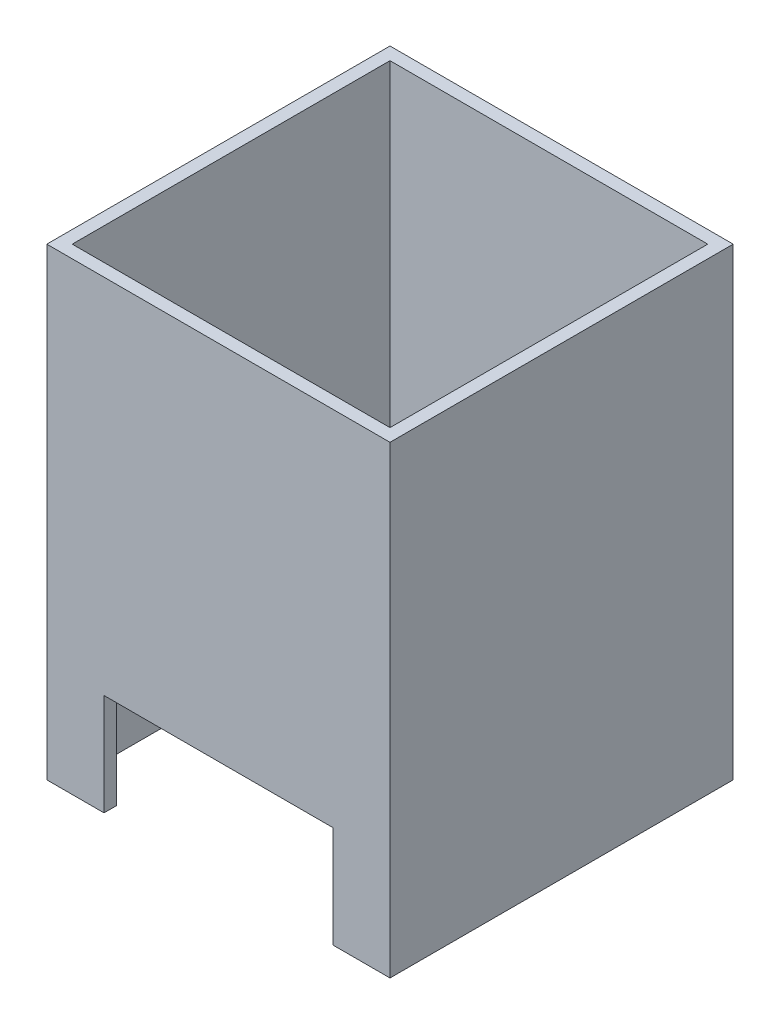
ISO-10303-21;
HEADER;
FILE_DESCRIPTION(('STEP AP214'),'2;1');
FILE_NAME('part.step','',(''),(''),'','','');
FILE_SCHEMA(('AUTOMOTIVE_DESIGN { 1 0 10303 214 1 1 1 1 }'));
ENDSEC;
DATA;
#1=APPLICATION_CONTEXT('core data for automotive mechanical design processes');
#2=APPLICATION_PROTOCOL_DEFINITION('international standard','automotive_design',2000,#1);
#3=PRODUCT_CONTEXT('',#1,'mechanical');
#4=PRODUCT('Part','Part','',(#3));
#5=PRODUCT_RELATED_PRODUCT_CATEGORY('part','',(#4));
#6=PRODUCT_DEFINITION_FORMATION('','',#4);
#7=PRODUCT_DEFINITION_CONTEXT('part definition',#1,'design');
#8=PRODUCT_DEFINITION('design','',#6,#7);
#9=PRODUCT_DEFINITION_SHAPE('','',#8);
#10=(LENGTH_UNIT() NAMED_UNIT(*) SI_UNIT(.MILLI.,.METRE.));
#11=(NAMED_UNIT(*) PLANE_ANGLE_UNIT() SI_UNIT($,.RADIAN.));
#12=(NAMED_UNIT(*) SI_UNIT($,.STERADIAN.) SOLID_ANGLE_UNIT());
#13=UNCERTAINTY_MEASURE_WITH_UNIT(LENGTH_MEASURE(1.E-05),#10,'distance_accuracy_value','');
#14=(GEOMETRIC_REPRESENTATION_CONTEXT(3) GLOBAL_UNCERTAINTY_ASSIGNED_CONTEXT((#13)) GLOBAL_UNIT_ASSIGNED_CONTEXT((#10,
#11,#12)) REPRESENTATION_CONTEXT('',''));
#15=CARTESIAN_POINT('',(0.,0.,0.));
#16=DIRECTION('',(0.,0.,1.));
#17=DIRECTION('',(1.,0.,0.));
#18=AXIS2_PLACEMENT_3D('',#15,#16,#17);
#19=CARTESIAN_POINT('',(0.,0.,0.));
#20=DIRECTION('',(0.,-1.,0.));
#21=DIRECTION('',(0.,0.,-1.));
#22=AXIS2_PLACEMENT_3D('',#19,#20,#21);
#23=PLANE('',#22);
#24=DIRECTION('',(0.,0.,1.));
#25=VECTOR('',#24,1.);
#26=CARTESIAN_POINT('',(18.,0.,-27.001));
#27=LINE('',#26,#25);
#28=CARTESIAN_POINT('',(18.,0.,25.));
#29=VERTEX_POINT('',#28);
#30=CARTESIAN_POINT('',(18.,0.,27.));
#31=VERTEX_POINT('',#30);
#32=EDGE_CURVE('E191',#29,#31,#27,.T.);
#33=ORIENTED_EDGE('',*,*,#32,.F.);
#34=DIRECTION('',(1.,0.,0.));
#35=VECTOR('',#34,1.);
#36=CARTESIAN_POINT('',(-25.,0.,25.));
#37=LINE('',#36,#35);
#38=CARTESIAN_POINT('',(25.,0.,25.));
#39=VERTEX_POINT('',#38);
#40=EDGE_CURVE('E196',#29,#39,#37,.T.);
#41=ORIENTED_EDGE('',*,*,#40,.T.);
#42=DIRECTION('',(0.,0.,-1.));
#43=VECTOR('',#42,1.);
#44=CARTESIAN_POINT('',(25.,0.,25.));
#45=LINE('',#44,#43);
#46=CARTESIAN_POINT('',(25.,0.,-25.));
#47=VERTEX_POINT('',#46);
#48=EDGE_CURVE('E269',#39,#47,#45,.T.);
#49=ORIENTED_EDGE('',*,*,#48,.T.);
#50=DIRECTION('',(-1.,0.,0.));
#51=VECTOR('',#50,1.);
#52=CARTESIAN_POINT('',(-25.,0.,-25.));
#53=LINE('',#52,#51);
#54=CARTESIAN_POINT('',(-25.,0.,-25.));
#55=VERTEX_POINT('',#54);
#56=EDGE_CURVE('E286',#47,#55,#53,.T.);
#57=ORIENTED_EDGE('',*,*,#56,.T.);
#58=DIRECTION('',(0.,0.,1.));
#59=VECTOR('',#58,1.);
#60=CARTESIAN_POINT('',(-25.,0.,25.));
#61=LINE('',#60,#59);
#62=CARTESIAN_POINT('',(-25.,0.,25.));
#63=VERTEX_POINT('',#62);
#64=EDGE_CURVE('E289',#55,#63,#61,.T.);
#65=ORIENTED_EDGE('',*,*,#64,.T.);
#66=CARTESIAN_POINT('',(-18.,0.,25.));
#67=VERTEX_POINT('',#66);
#68=EDGE_CURVE('E274',#63,#67,#37,.T.);
#69=ORIENTED_EDGE('',*,*,#68,.T.);
#70=DIRECTION('',(0.,0.,1.));
#71=VECTOR('',#70,1.);
#72=CARTESIAN_POINT('',(-18.,0.,-27.001));
#73=LINE('',#72,#71);
#74=CARTESIAN_POINT('',(-18.,0.,27.));
#75=VERTEX_POINT('',#74);
#76=EDGE_CURVE('E50',#67,#75,#73,.T.);
#77=ORIENTED_EDGE('',*,*,#76,.T.);
#78=DIRECTION('',(1.,0.,0.));
#79=VECTOR('',#78,1.);
#80=CARTESIAN_POINT('',(-27.,0.,27.));
#81=LINE('',#80,#79);
#82=CARTESIAN_POINT('',(-27.,0.,27.));
#83=VERTEX_POINT('',#82);
#84=EDGE_CURVE('E310',#83,#75,#81,.T.);
#85=ORIENTED_EDGE('',*,*,#84,.F.);
#86=DIRECTION('',(0.,0.,1.));
#87=VECTOR('',#86,1.);
#88=CARTESIAN_POINT('',(-27.,0.,27.));
#89=LINE('',#88,#87);
#90=CARTESIAN_POINT('',(-27.,0.,-27.));
#91=VERTEX_POINT('',#90);
#92=EDGE_CURVE('E307',#91,#83,#89,.T.);
#93=ORIENTED_EDGE('',*,*,#92,.F.);
#94=DIRECTION('',(-1.,0.,0.));
#95=VECTOR('',#94,1.);
#96=CARTESIAN_POINT('',(-27.,0.,-27.));
#97=LINE('',#96,#95);
#98=CARTESIAN_POINT('',(27.,0.,-27.));
#99=VERTEX_POINT('',#98);
#100=EDGE_CURVE('E305',#99,#91,#97,.T.);
#101=ORIENTED_EDGE('',*,*,#100,.F.);
#102=DIRECTION('',(0.,0.,-1.));
#103=VECTOR('',#102,1.);
#104=CARTESIAN_POINT('',(27.,0.,27.));
#105=LINE('',#104,#103);
#106=CARTESIAN_POINT('',(27.,0.,27.));
#107=VERTEX_POINT('',#106);
#108=EDGE_CURVE('E302',#107,#99,#105,.T.);
#109=ORIENTED_EDGE('',*,*,#108,.F.);
#110=EDGE_CURVE('E309',#31,#107,#81,.T.);
#111=ORIENTED_EDGE('',*,*,#110,.F.);
#112=EDGE_LOOP('',(#33,#41,#49,#57,#65,#69,#77,#85,#93,#101,#109,#111));
#113=FACE_BOUND('',#112,.T.);
#114=ADVANCED_FACE('F35',(#113),#23,.T.);
#115=CARTESIAN_POINT('',(27.,22.,27.));
#116=DIRECTION('',(-1.,0.,0.));
#117=DIRECTION('',(0.,0.,1.));
#118=AXIS2_PLACEMENT_3D('',#115,#116,#117);
#119=PLANE('',#118);
#120=ORIENTED_EDGE('',*,*,#108,.T.);
#121=DIRECTION('',(0.,-1.,0.));
#122=VECTOR('',#121,1.);
#123=CARTESIAN_POINT('',(27.,22.,-27.));
#124=LINE('',#123,#122);
#125=CARTESIAN_POINT('',(27.,73.,-27.));
#126=VERTEX_POINT('',#125);
#127=EDGE_CURVE('E322',#126,#99,#124,.T.);
#128=ORIENTED_EDGE('',*,*,#127,.F.);
#129=DIRECTION('',(0.,0.,-1.));
#130=VECTOR('',#129,1.);
#131=CARTESIAN_POINT('',(27.,73.,0.));
#132=LINE('',#131,#130);
#133=CARTESIAN_POINT('',(27.,73.,27.));
#134=VERTEX_POINT('',#133);
#135=EDGE_CURVE('E227',#134,#126,#132,.T.);
#136=ORIENTED_EDGE('',*,*,#135,.F.);
#137=DIRECTION('',(0.,-1.,0.));
#138=VECTOR('',#137,1.);
#139=CARTESIAN_POINT('',(27.,22.,27.));
#140=LINE('',#139,#138);
#141=EDGE_CURVE('E313',#134,#107,#140,.T.);
#142=ORIENTED_EDGE('',*,*,#141,.T.);
#143=EDGE_LOOP('',(#120,#128,#136,#142));
#144=FACE_BOUND('',#143,.T.);
#145=ADVANCED_FACE('F37',(#144),#119,.F.);
#146=CARTESIAN_POINT('',(-27.,22.,-27.));
#147=DIRECTION('',(0.,0.,1.));
#148=DIRECTION('',(1.,0.,0.));
#149=AXIS2_PLACEMENT_3D('',#146,#147,#148);
#150=PLANE('',#149);
#151=ORIENTED_EDGE('',*,*,#100,.T.);
#152=DIRECTION('',(0.,-1.,0.));
#153=VECTOR('',#152,1.);
#154=CARTESIAN_POINT('',(-27.,22.,-27.));
#155=LINE('',#154,#153);
#156=CARTESIAN_POINT('',(-27.,73.,-27.));
#157=VERTEX_POINT('',#156);
#158=EDGE_CURVE('E319',#157,#91,#155,.T.);
#159=ORIENTED_EDGE('',*,*,#158,.F.);
#160=DIRECTION('',(-1.,0.,0.));
#161=VECTOR('',#160,1.);
#162=CARTESIAN_POINT('',(0.,73.,-27.));
#163=LINE('',#162,#161);
#164=EDGE_CURVE('E230',#126,#157,#163,.T.);
#165=ORIENTED_EDGE('',*,*,#164,.F.);
#166=ORIENTED_EDGE('',*,*,#127,.T.);
#167=EDGE_LOOP('',(#151,#159,#165,#166));
#168=FACE_BOUND('',#167,.T.);
#169=ADVANCED_FACE('F370',(#168),#150,.F.);
#170=CARTESIAN_POINT('',(-27.,22.,27.));
#171=DIRECTION('',(1.,0.,0.));
#172=DIRECTION('',(0.,0.,-1.));
#173=AXIS2_PLACEMENT_3D('',#170,#171,#172);
#174=PLANE('',#173);
#175=ORIENTED_EDGE('',*,*,#92,.T.);
#176=DIRECTION('',(0.,-1.,0.));
#177=VECTOR('',#176,1.);
#178=CARTESIAN_POINT('',(-27.,22.,27.));
#179=LINE('',#178,#177);
#180=CARTESIAN_POINT('',(-27.,73.,27.));
#181=VERTEX_POINT('',#180);
#182=EDGE_CURVE('E316',#181,#83,#179,.T.);
#183=ORIENTED_EDGE('',*,*,#182,.F.);
#184=DIRECTION('',(0.,0.,1.));
#185=VECTOR('',#184,1.);
#186=CARTESIAN_POINT('',(-27.,73.,0.));
#187=LINE('',#186,#185);
#188=EDGE_CURVE('E234',#157,#181,#187,.T.);
#189=ORIENTED_EDGE('',*,*,#188,.F.);
#190=ORIENTED_EDGE('',*,*,#158,.T.);
#191=EDGE_LOOP('',(#175,#183,#189,#190));
#192=FACE_BOUND('',#191,.T.);
#193=ADVANCED_FACE('F378',(#192),#174,.F.);
#194=CARTESIAN_POINT('',(-27.,22.,27.));
#195=DIRECTION('',(0.,0.,-1.));
#196=DIRECTION('',(-1.,0.,0.));
#197=AXIS2_PLACEMENT_3D('',#194,#195,#196);
#198=PLANE('',#197);
#199=DIRECTION('',(-1.,0.,0.));
#200=VECTOR('',#199,1.);
#201=CARTESIAN_POINT('',(-18.,16.,27.));
#202=LINE('',#201,#200);
#203=CARTESIAN_POINT('',(18.,16.,27.));
#204=VERTEX_POINT('',#203);
#205=CARTESIAN_POINT('',(-18.,16.,27.));
#206=VERTEX_POINT('',#205);
#207=EDGE_CURVE('E203',#204,#206,#202,.T.);
#208=ORIENTED_EDGE('',*,*,#207,.F.);
#209=DIRECTION('',(0.,1.,0.));
#210=VECTOR('',#209,1.);
#211=CARTESIAN_POINT('',(18.,0.,27.));
#212=LINE('',#211,#210);
#213=EDGE_CURVE('E189',#31,#204,#212,.T.);
#214=ORIENTED_EDGE('',*,*,#213,.F.);
#215=ORIENTED_EDGE('',*,*,#110,.T.);
#216=ORIENTED_EDGE('',*,*,#141,.F.);
#217=DIRECTION('',(1.,0.,0.));
#218=VECTOR('',#217,1.);
#219=CARTESIAN_POINT('',(0.,73.,27.));
#220=LINE('',#219,#218);
#221=EDGE_CURVE('E237',#181,#134,#220,.T.);
#222=ORIENTED_EDGE('',*,*,#221,.F.);
#223=ORIENTED_EDGE('',*,*,#182,.T.);
#224=ORIENTED_EDGE('',*,*,#84,.T.);
#225=DIRECTION('',(0.,-1.,0.));
#226=VECTOR('',#225,1.);
#227=CARTESIAN_POINT('',(-18.,0.,27.));
#228=LINE('',#227,#226);
#229=EDGE_CURVE('E200',#206,#75,#228,.T.);
#230=ORIENTED_EDGE('',*,*,#229,.F.);
#231=EDGE_LOOP('',(#208,#214,#215,#216,#222,#223,#224,#230));
#232=FACE_BOUND('',#231,.T.);
#233=ADVANCED_FACE('F376',(#232),#198,.F.);
#234=CARTESIAN_POINT('',(25.,22.,25.));
#235=DIRECTION('',(-1.,0.,0.));
#236=DIRECTION('',(0.,0.,1.));
#237=AXIS2_PLACEMENT_3D('',#234,#235,#236);
#238=PLANE('',#237);
#239=ORIENTED_EDGE('',*,*,#48,.F.);
#240=DIRECTION('',(0.,-1.,0.));
#241=VECTOR('',#240,1.);
#242=CARTESIAN_POINT('',(25.,22.,25.));
#243=LINE('',#242,#241);
#244=CARTESIAN_POINT('',(25.,22.,25.));
#245=VERTEX_POINT('',#244);
#246=EDGE_CURVE('E283',#245,#39,#243,.T.);
#247=ORIENTED_EDGE('',*,*,#246,.F.);
#248=DIRECTION('',(0.,0.,-1.));
#249=VECTOR('',#248,1.);
#250=CARTESIAN_POINT('',(25.,22.,25.));
#251=LINE('',#250,#249);
#252=CARTESIAN_POINT('',(25.,22.,-25.));
#253=VERTEX_POINT('',#252);
#254=EDGE_CURVE('E270',#245,#253,#251,.T.);
#255=ORIENTED_EDGE('',*,*,#254,.T.);
#256=DIRECTION('',(0.,-1.,0.));
#257=VECTOR('',#256,1.);
#258=CARTESIAN_POINT('',(25.,22.,-25.));
#259=LINE('',#258,#257);
#260=EDGE_CURVE('E299',#253,#47,#259,.T.);
#261=ORIENTED_EDGE('',*,*,#260,.T.);
#262=EDGE_LOOP('',(#239,#247,#255,#261));
#263=FACE_BOUND('',#262,.T.);
#264=ADVANCED_FACE('F374',(#263),#238,.T.);
#265=CARTESIAN_POINT('',(-25.,22.,-25.));
#266=DIRECTION('',(0.,0.,1.));
#267=DIRECTION('',(1.,0.,0.));
#268=AXIS2_PLACEMENT_3D('',#265,#266,#267);
#269=PLANE('',#268);
#270=ORIENTED_EDGE('',*,*,#56,.F.);
#271=ORIENTED_EDGE('',*,*,#260,.F.);
#272=DIRECTION('',(-1.,0.,0.));
#273=VECTOR('',#272,1.);
#274=CARTESIAN_POINT('',(-25.,22.,-25.));
#275=LINE('',#274,#273);
#276=CARTESIAN_POINT('',(-25.,22.,-25.));
#277=VERTEX_POINT('',#276);
#278=EDGE_CURVE('E273',#253,#277,#275,.T.);
#279=ORIENTED_EDGE('',*,*,#278,.T.);
#280=DIRECTION('',(0.,-1.,0.));
#281=VECTOR('',#280,1.);
#282=CARTESIAN_POINT('',(-25.,22.,-25.));
#283=LINE('',#282,#281);
#284=EDGE_CURVE('E297',#277,#55,#283,.T.);
#285=ORIENTED_EDGE('',*,*,#284,.T.);
#286=EDGE_LOOP('',(#270,#271,#279,#285));
#287=FACE_BOUND('',#286,.T.);
#288=ADVANCED_FACE('F403',(#287),#269,.T.);
#289=CARTESIAN_POINT('',(-25.,22.,25.));
#290=DIRECTION('',(1.,0.,0.));
#291=DIRECTION('',(0.,0.,-1.));
#292=AXIS2_PLACEMENT_3D('',#289,#290,#291);
#293=PLANE('',#292);
#294=ORIENTED_EDGE('',*,*,#64,.F.);
#295=ORIENTED_EDGE('',*,*,#284,.F.);
#296=DIRECTION('',(0.,0.,1.));
#297=VECTOR('',#296,1.);
#298=CARTESIAN_POINT('',(-25.,22.,25.));
#299=LINE('',#298,#297);
#300=CARTESIAN_POINT('',(-25.,22.,25.));
#301=VERTEX_POINT('',#300);
#302=EDGE_CURVE('E277',#277,#301,#299,.T.);
#303=ORIENTED_EDGE('',*,*,#302,.T.);
#304=DIRECTION('',(0.,-1.,0.));
#305=VECTOR('',#304,1.);
#306=CARTESIAN_POINT('',(-25.,22.,25.));
#307=LINE('',#306,#305);
#308=EDGE_CURVE('E295',#301,#63,#307,.T.);
#309=ORIENTED_EDGE('',*,*,#308,.T.);
#310=EDGE_LOOP('',(#294,#295,#303,#309));
#311=FACE_BOUND('',#310,.T.);
#312=ADVANCED_FACE('F407',(#311),#293,.T.);
#313=CARTESIAN_POINT('',(-25.,22.,25.));
#314=DIRECTION('',(0.,0.,-1.));
#315=DIRECTION('',(-1.,0.,0.));
#316=AXIS2_PLACEMENT_3D('',#313,#314,#315);
#317=PLANE('',#316);
#318=DIRECTION('',(0.,1.,0.));
#319=VECTOR('',#318,1.);
#320=CARTESIAN_POINT('',(18.,0.,25.));
#321=LINE('',#320,#319);
#322=CARTESIAN_POINT('',(18.,16.,25.));
#323=VERTEX_POINT('',#322);
#324=EDGE_CURVE('E183',#29,#323,#321,.T.);
#325=ORIENTED_EDGE('',*,*,#324,.T.);
#326=DIRECTION('',(-1.,0.,0.));
#327=VECTOR('',#326,1.);
#328=CARTESIAN_POINT('',(-18.,16.,25.));
#329=LINE('',#328,#327);
#330=CARTESIAN_POINT('',(-18.,16.,25.));
#331=VERTEX_POINT('',#330);
#332=EDGE_CURVE('E173',#323,#331,#329,.T.);
#333=ORIENTED_EDGE('',*,*,#332,.T.);
#334=DIRECTION('',(0.,-1.,0.));
#335=VECTOR('',#334,1.);
#336=CARTESIAN_POINT('',(-18.,0.,25.));
#337=LINE('',#336,#335);
#338=EDGE_CURVE('E182',#331,#67,#337,.T.);
#339=ORIENTED_EDGE('',*,*,#338,.T.);
#340=ORIENTED_EDGE('',*,*,#68,.F.);
#341=ORIENTED_EDGE('',*,*,#308,.F.);
#342=DIRECTION('',(1.,0.,0.));
#343=VECTOR('',#342,1.);
#344=CARTESIAN_POINT('',(-25.,22.,25.));
#345=LINE('',#344,#343);
#346=EDGE_CURVE('E280',#301,#245,#345,.T.);
#347=ORIENTED_EDGE('',*,*,#346,.T.);
#348=ORIENTED_EDGE('',*,*,#246,.T.);
#349=ORIENTED_EDGE('',*,*,#40,.F.);
#350=EDGE_LOOP('',(#325,#333,#339,#340,#341,#347,#348,#349));
#351=FACE_BOUND('',#350,.T.);
#352=ADVANCED_FACE('F194',(#351),#317,.T.);
#353=CARTESIAN_POINT('',(0.,22.,0.));
#354=DIRECTION('',(0.,-1.,0.));
#355=DIRECTION('',(0.,0.,-1.));
#356=AXIS2_PLACEMENT_3D('',#353,#354,#355);
#357=PLANE('',#356);
#358=DIRECTION('',(0.,0.,1.));
#359=VECTOR('',#358,1.);
#360=CARTESIAN_POINT('',(16.5,22.,-16.5));
#361=LINE('',#360,#359);
#362=CARTESIAN_POINT('',(16.5,22.,-16.5));
#363=VERTEX_POINT('',#362);
#364=CARTESIAN_POINT('',(16.5,22.,16.5));
#365=VERTEX_POINT('',#364);
#366=EDGE_CURVE('E58',#363,#365,#361,.T.);
#367=ORIENTED_EDGE('',*,*,#366,.F.);
#368=DIRECTION('',(1.,0.,0.));
#369=VECTOR('',#368,1.);
#370=CARTESIAN_POINT('',(-16.5,22.,-16.5));
#371=LINE('',#370,#369);
#372=CARTESIAN_POINT('',(-16.5,22.,-16.5));
#373=VERTEX_POINT('',#372);
#374=EDGE_CURVE('E215',#373,#363,#371,.T.);
#375=ORIENTED_EDGE('',*,*,#374,.F.);
#376=DIRECTION('',(0.,0.,-1.));
#377=VECTOR('',#376,1.);
#378=CARTESIAN_POINT('',(-16.5,22.,-16.5));
#379=LINE('',#378,#377);
#380=CARTESIAN_POINT('',(-16.5,22.,16.5));
#381=VERTEX_POINT('',#380);
#382=EDGE_CURVE('E212',#381,#373,#379,.T.);
#383=ORIENTED_EDGE('',*,*,#382,.F.);
#384=DIRECTION('',(-1.,0.,0.));
#385=VECTOR('',#384,1.);
#386=CARTESIAN_POINT('',(-16.5,22.,16.5));
#387=LINE('',#386,#385);
#388=EDGE_CURVE('E209',#365,#381,#387,.T.);
#389=ORIENTED_EDGE('',*,*,#388,.F.);
#390=EDGE_LOOP('',(#367,#375,#383,#389));
#391=FACE_BOUND('',#390,.T.);
#392=ORIENTED_EDGE('',*,*,#254,.F.);
#393=ORIENTED_EDGE('',*,*,#346,.F.);
#394=ORIENTED_EDGE('',*,*,#302,.F.);
#395=ORIENTED_EDGE('',*,*,#278,.F.);
#396=EDGE_LOOP('',(#392,#393,#394,#395));
#397=FACE_BOUND('',#396,.T.);
#398=ADVANCED_FACE('F345',(#391,#397),#357,.T.);
#399=CARTESIAN_POINT('',(0.,23.,0.));
#400=DIRECTION('',(0.,-1.,0.));
#401=DIRECTION('',(0.,0.,-1.));
#402=AXIS2_PLACEMENT_3D('',#399,#400,#401);
#403=PLANE('',#402);
#404=DIRECTION('',(1.,0.,0.));
#405=VECTOR('',#404,1.);
#406=CARTESIAN_POINT('',(0.,23.,-16.5));
#407=LINE('',#406,#405);
#408=CARTESIAN_POINT('',(-16.5,23.,-16.5));
#409=VERTEX_POINT('',#408);
#410=CARTESIAN_POINT('',(16.5,23.,-16.5));
#411=VERTEX_POINT('',#410);
#412=EDGE_CURVE('E43',#409,#411,#407,.T.);
#413=ORIENTED_EDGE('',*,*,#412,.T.);
#414=DIRECTION('',(0.,0.,1.));
#415=VECTOR('',#414,1.);
#416=CARTESIAN_POINT('',(16.5,23.,0.));
#417=LINE('',#416,#415);
#418=CARTESIAN_POINT('',(16.5,23.,16.5));
#419=VERTEX_POINT('',#418);
#420=EDGE_CURVE('E11',#411,#419,#417,.T.);
#421=ORIENTED_EDGE('',*,*,#420,.T.);
#422=DIRECTION('',(-1.,0.,0.));
#423=VECTOR('',#422,1.);
#424=CARTESIAN_POINT('',(0.,23.,16.5));
#425=LINE('',#424,#423);
#426=CARTESIAN_POINT('',(-16.5,23.,16.5));
#427=VERTEX_POINT('',#426);
#428=EDGE_CURVE('E325',#419,#427,#425,.T.);
#429=ORIENTED_EDGE('',*,*,#428,.T.);
#430=DIRECTION('',(0.,0.,-1.));
#431=VECTOR('',#430,1.);
#432=CARTESIAN_POINT('',(-16.5,23.,0.));
#433=LINE('',#432,#431);
#434=EDGE_CURVE('E328',#427,#409,#433,.T.);
#435=ORIENTED_EDGE('',*,*,#434,.T.);
#436=EDGE_LOOP('',(#413,#421,#429,#435));
#437=FACE_BOUND('',#436,.T.);
#438=DIRECTION('',(1.,0.,0.));
#439=VECTOR('',#438,1.);
#440=CARTESIAN_POINT('',(0.,23.,-25.));
#441=LINE('',#440,#439);
#442=CARTESIAN_POINT('',(-25.,23.,-25.));
#443=VERTEX_POINT('',#442);
#444=CARTESIAN_POINT('',(25.,23.,-25.));
#445=VERTEX_POINT('',#444);
#446=EDGE_CURVE('E254',#443,#445,#441,.T.);
#447=ORIENTED_EDGE('',*,*,#446,.F.);
#448=DIRECTION('',(0.,0.,1.));
#449=VECTOR('',#448,1.);
#450=CARTESIAN_POINT('',(-25.,23.,0.));
#451=LINE('',#450,#449);
#452=CARTESIAN_POINT('',(-25.,23.,25.));
#453=VERTEX_POINT('',#452);
#454=EDGE_CURVE('E221',#443,#453,#451,.T.);
#455=ORIENTED_EDGE('',*,*,#454,.T.);
#456=DIRECTION('',(1.,0.,0.));
#457=VECTOR('',#456,1.);
#458=CARTESIAN_POINT('',(0.,23.,25.));
#459=LINE('',#458,#457);
#460=CARTESIAN_POINT('',(25.,23.,25.));
#461=VERTEX_POINT('',#460);
#462=EDGE_CURVE('E231',#453,#461,#459,.T.);
#463=ORIENTED_EDGE('',*,*,#462,.T.);
#464=DIRECTION('',(0.,0.,1.));
#465=VECTOR('',#464,1.);
#466=CARTESIAN_POINT('',(25.,23.,0.));
#467=LINE('',#466,#465);
#468=EDGE_CURVE('E257',#445,#461,#467,.T.);
#469=ORIENTED_EDGE('',*,*,#468,.F.);
#470=EDGE_LOOP('',(#447,#455,#463,#469));
#471=FACE_BOUND('',#470,.T.);
#472=ADVANCED_FACE('F332',(#437,#471),#403,.F.);
#473=CARTESIAN_POINT('',(-25.,73.,0.));
#474=DIRECTION('',(1.,0.,0.));
#475=DIRECTION('',(0.,0.,-1.));
#476=AXIS2_PLACEMENT_3D('',#473,#474,#475);
#477=PLANE('',#476);
#478=ORIENTED_EDGE('',*,*,#454,.F.);
#479=DIRECTION('',(0.,-1.,0.));
#480=VECTOR('',#479,1.);
#481=CARTESIAN_POINT('',(-25.,73.,-25.));
#482=LINE('',#481,#480);
#483=CARTESIAN_POINT('',(-25.,73.,-25.));
#484=VERTEX_POINT('',#483);
#485=EDGE_CURVE('E267',#484,#443,#482,.T.);
#486=ORIENTED_EDGE('',*,*,#485,.F.);
#487=DIRECTION('',(0.,0.,1.));
#488=VECTOR('',#487,1.);
#489=CARTESIAN_POINT('',(-25.,73.,0.));
#490=LINE('',#489,#488);
#491=CARTESIAN_POINT('',(-25.,73.,25.));
#492=VERTEX_POINT('',#491);
#493=EDGE_CURVE('E240',#484,#492,#490,.T.);
#494=ORIENTED_EDGE('',*,*,#493,.T.);
#495=DIRECTION('',(0.,-1.,0.));
#496=VECTOR('',#495,1.);
#497=CARTESIAN_POINT('',(-25.,73.,25.));
#498=LINE('',#497,#496);
#499=EDGE_CURVE('E251',#492,#453,#498,.T.);
#500=ORIENTED_EDGE('',*,*,#499,.T.);
#501=EDGE_LOOP('',(#478,#486,#494,#500));
#502=FACE_BOUND('',#501,.T.);
#503=ADVANCED_FACE('F481',(#502),#477,.T.);
#504=CARTESIAN_POINT('',(0.,73.,-25.));
#505=DIRECTION('',(0.,0.,-1.));
#506=DIRECTION('',(-1.,0.,0.));
#507=AXIS2_PLACEMENT_3D('',#504,#505,#506);
#508=PLANE('',#507);
#509=ORIENTED_EDGE('',*,*,#446,.T.);
#510=DIRECTION('',(0.,-1.,0.));
#511=VECTOR('',#510,1.);
#512=CARTESIAN_POINT('',(25.,73.,-25.));
#513=LINE('',#512,#511);
#514=CARTESIAN_POINT('',(25.,73.,-25.));
#515=VERTEX_POINT('',#514);
#516=EDGE_CURVE('E265',#515,#445,#513,.T.);
#517=ORIENTED_EDGE('',*,*,#516,.F.);
#518=DIRECTION('',(1.,0.,0.));
#519=VECTOR('',#518,1.);
#520=CARTESIAN_POINT('',(0.,73.,-25.));
#521=LINE('',#520,#519);
#522=EDGE_CURVE('E243',#484,#515,#521,.T.);
#523=ORIENTED_EDGE('',*,*,#522,.F.);
#524=ORIENTED_EDGE('',*,*,#485,.T.);
#525=EDGE_LOOP('',(#509,#517,#523,#524));
#526=FACE_BOUND('',#525,.T.);
#527=ADVANCED_FACE('F492',(#526),#508,.F.);
#528=CARTESIAN_POINT('',(25.,73.,0.));
#529=DIRECTION('',(1.,0.,0.));
#530=DIRECTION('',(0.,0.,-1.));
#531=AXIS2_PLACEMENT_3D('',#528,#529,#530);
#532=PLANE('',#531);
#533=ORIENTED_EDGE('',*,*,#468,.T.);
#534=DIRECTION('',(0.,-1.,0.));
#535=VECTOR('',#534,1.);
#536=CARTESIAN_POINT('',(25.,73.,25.));
#537=LINE('',#536,#535);
#538=CARTESIAN_POINT('',(25.,73.,25.));
#539=VERTEX_POINT('',#538);
#540=EDGE_CURVE('E262',#539,#461,#537,.T.);
#541=ORIENTED_EDGE('',*,*,#540,.F.);
#542=DIRECTION('',(0.,0.,1.));
#543=VECTOR('',#542,1.);
#544=CARTESIAN_POINT('',(25.,73.,0.));
#545=LINE('',#544,#543);
#546=EDGE_CURVE('E246',#515,#539,#545,.T.);
#547=ORIENTED_EDGE('',*,*,#546,.F.);
#548=ORIENTED_EDGE('',*,*,#516,.T.);
#549=EDGE_LOOP('',(#533,#541,#547,#548));
#550=FACE_BOUND('',#549,.T.);
#551=ADVANCED_FACE('F501',(#550),#532,.F.);
#552=CARTESIAN_POINT('',(0.,73.,25.));
#553=DIRECTION('',(0.,0.,-1.));
#554=DIRECTION('',(-1.,0.,0.));
#555=AXIS2_PLACEMENT_3D('',#552,#553,#554);
#556=PLANE('',#555);
#557=ORIENTED_EDGE('',*,*,#462,.F.);
#558=ORIENTED_EDGE('',*,*,#499,.F.);
#559=DIRECTION('',(1.,0.,0.));
#560=VECTOR('',#559,1.);
#561=CARTESIAN_POINT('',(0.,73.,25.));
#562=LINE('',#561,#560);
#563=EDGE_CURVE('E248',#492,#539,#562,.T.);
#564=ORIENTED_EDGE('',*,*,#563,.T.);
#565=ORIENTED_EDGE('',*,*,#540,.T.);
#566=EDGE_LOOP('',(#557,#558,#564,#565));
#567=FACE_BOUND('',#566,.T.);
#568=ADVANCED_FACE('F358',(#567),#556,.T.);
#569=CARTESIAN_POINT('',(0.,73.,0.));
#570=DIRECTION('',(0.,1.,0.));
#571=DIRECTION('',(0.,0.,1.));
#572=AXIS2_PLACEMENT_3D('',#569,#570,#571);
#573=PLANE('',#572);
#574=ORIENTED_EDGE('',*,*,#135,.T.);
#575=ORIENTED_EDGE('',*,*,#164,.T.);
#576=ORIENTED_EDGE('',*,*,#188,.T.);
#577=ORIENTED_EDGE('',*,*,#221,.T.);
#578=EDGE_LOOP('',(#574,#575,#576,#577));
#579=FACE_BOUND('',#578,.T.);
#580=ORIENTED_EDGE('',*,*,#493,.F.);
#581=ORIENTED_EDGE('',*,*,#522,.T.);
#582=ORIENTED_EDGE('',*,*,#546,.T.);
#583=ORIENTED_EDGE('',*,*,#563,.F.);
#584=EDGE_LOOP('',(#580,#581,#582,#583));
#585=FACE_BOUND('',#584,.T.);
#586=ADVANCED_FACE('F351',(#579,#585),#573,.T.);
#587=CARTESIAN_POINT('',(16.5,73.,-16.5));
#588=DIRECTION('',(1.,0.,0.));
#589=DIRECTION('',(0.,0.,-1.));
#590=AXIS2_PLACEMENT_3D('',#587,#588,#589);
#591=PLANE('',#590);
#592=DIRECTION('',(0.,-1.,0.));
#593=VECTOR('',#592,1.);
#594=CARTESIAN_POINT('',(16.5,73.,-16.5));
#595=LINE('',#594,#593);
#596=EDGE_CURVE('E219',#411,#363,#595,.T.);
#597=ORIENTED_EDGE('',*,*,#596,.T.);
#598=ORIENTED_EDGE('',*,*,#366,.T.);
#599=DIRECTION('',(0.,-1.,0.));
#600=VECTOR('',#599,1.);
#601=CARTESIAN_POINT('',(16.5,73.,16.5));
#602=LINE('',#601,#600);
#603=EDGE_CURVE('E218',#419,#365,#602,.T.);
#604=ORIENTED_EDGE('',*,*,#603,.F.);
#605=ORIENTED_EDGE('',*,*,#420,.F.);
#606=EDGE_LOOP('',(#597,#598,#604,#605));
#607=FACE_BOUND('',#606,.T.);
#608=ADVANCED_FACE('F349',(#607),#591,.F.);
#609=CARTESIAN_POINT('',(-16.5,73.,-16.5));
#610=DIRECTION('',(0.,0.,-1.));
#611=DIRECTION('',(-1.,0.,0.));
#612=AXIS2_PLACEMENT_3D('',#609,#610,#611);
#613=PLANE('',#612);
#614=DIRECTION('',(0.,-1.,0.));
#615=VECTOR('',#614,1.);
#616=CARTESIAN_POINT('',(-16.5,73.,-16.5));
#617=LINE('',#616,#615);
#618=EDGE_CURVE('E222',#409,#373,#617,.T.);
#619=ORIENTED_EDGE('',*,*,#618,.T.);
#620=ORIENTED_EDGE('',*,*,#374,.T.);
#621=ORIENTED_EDGE('',*,*,#596,.F.);
#622=ORIENTED_EDGE('',*,*,#412,.F.);
#623=EDGE_LOOP('',(#619,#620,#621,#622));
#624=FACE_BOUND('',#623,.T.);
#625=ADVANCED_FACE('F338',(#624),#613,.F.);
#626=CARTESIAN_POINT('',(-16.5,73.,-16.5));
#627=DIRECTION('',(-1.,0.,0.));
#628=DIRECTION('',(0.,0.,1.));
#629=AXIS2_PLACEMENT_3D('',#626,#627,#628);
#630=PLANE('',#629);
#631=DIRECTION('',(0.,-1.,0.));
#632=VECTOR('',#631,1.);
#633=CARTESIAN_POINT('',(-16.5,73.,16.5));
#634=LINE('',#633,#632);
#635=EDGE_CURVE('E224',#427,#381,#634,.T.);
#636=ORIENTED_EDGE('',*,*,#635,.T.);
#637=ORIENTED_EDGE('',*,*,#382,.T.);
#638=ORIENTED_EDGE('',*,*,#618,.F.);
#639=ORIENTED_EDGE('',*,*,#434,.F.);
#640=EDGE_LOOP('',(#636,#637,#638,#639));
#641=FACE_BOUND('',#640,.T.);
#642=ADVANCED_FACE('F340',(#641),#630,.F.);
#643=CARTESIAN_POINT('',(-16.5,73.,16.5));
#644=DIRECTION('',(0.,0.,1.));
#645=DIRECTION('',(1.,0.,0.));
#646=AXIS2_PLACEMENT_3D('',#643,#644,#645);
#647=PLANE('',#646);
#648=ORIENTED_EDGE('',*,*,#603,.T.);
#649=ORIENTED_EDGE('',*,*,#388,.T.);
#650=ORIENTED_EDGE('',*,*,#635,.F.);
#651=ORIENTED_EDGE('',*,*,#428,.F.);
#652=EDGE_LOOP('',(#648,#649,#650,#651));
#653=FACE_BOUND('',#652,.T.);
#654=ADVANCED_FACE('F348',(#653),#647,.F.);
#655=CARTESIAN_POINT('',(18.,0.,-27.001));
#656=DIRECTION('',(1.,0.,0.));
#657=DIRECTION('',(0.,0.,-1.));
#658=AXIS2_PLACEMENT_3D('',#655,#656,#657);
#659=PLANE('',#658);
#660=ORIENTED_EDGE('',*,*,#32,.T.);
#661=ORIENTED_EDGE('',*,*,#213,.T.);
#662=DIRECTION('',(0.,0.,1.));
#663=VECTOR('',#662,1.);
#664=CARTESIAN_POINT('',(18.,16.,-27.001));
#665=LINE('',#664,#663);
#666=EDGE_CURVE('E177',#323,#204,#665,.T.);
#667=ORIENTED_EDGE('',*,*,#666,.F.);
#668=ORIENTED_EDGE('',*,*,#324,.F.);
#669=EDGE_LOOP('',(#660,#661,#667,#668));
#670=FACE_BOUND('',#669,.T.);
#671=ADVANCED_FACE('F186',(#670),#659,.F.);
#672=CARTESIAN_POINT('',(-18.,16.,-27.001));
#673=DIRECTION('',(0.,1.,0.));
#674=DIRECTION('',(0.,0.,1.));
#675=AXIS2_PLACEMENT_3D('',#672,#673,#674);
#676=PLANE('',#675);
#677=ORIENTED_EDGE('',*,*,#666,.T.);
#678=ORIENTED_EDGE('',*,*,#207,.T.);
#679=DIRECTION('',(0.,0.,1.));
#680=VECTOR('',#679,1.);
#681=CARTESIAN_POINT('',(-18.,16.,-27.001));
#682=LINE('',#681,#680);
#683=EDGE_CURVE('E179',#331,#206,#682,.T.);
#684=ORIENTED_EDGE('',*,*,#683,.F.);
#685=ORIENTED_EDGE('',*,*,#332,.F.);
#686=EDGE_LOOP('',(#677,#678,#684,#685));
#687=FACE_BOUND('',#686,.T.);
#688=ADVANCED_FACE('F175',(#687),#676,.F.);
#689=CARTESIAN_POINT('',(-18.,0.,-27.001));
#690=DIRECTION('',(-1.,0.,0.));
#691=DIRECTION('',(0.,0.,1.));
#692=AXIS2_PLACEMENT_3D('',#689,#690,#691);
#693=PLANE('',#692);
#694=ORIENTED_EDGE('',*,*,#683,.T.);
#695=ORIENTED_EDGE('',*,*,#229,.T.);
#696=ORIENTED_EDGE('',*,*,#76,.F.);
#697=ORIENTED_EDGE('',*,*,#338,.F.);
#698=EDGE_LOOP('',(#694,#695,#696,#697));
#699=FACE_BOUND('',#698,.T.);
#700=ADVANCED_FACE('F408',(#699),#693,.F.);
#701=CLOSED_SHELL('',(#114,#145,#169,#193,#233,#264,#288,#312,#352,#398,#472,#503,#527,#551,
#568,#586,#608,#625,#642,#654,#671,#688,#700));
#702=MANIFOLD_SOLID_BREP('B2',#701);
#703=ADVANCED_BREP_SHAPE_REPRESENTATION('',(#18,#702),#14);
#704=SHAPE_DEFINITION_REPRESENTATION(#9,#703);
ENDSEC;
END-ISO-10303-21;
